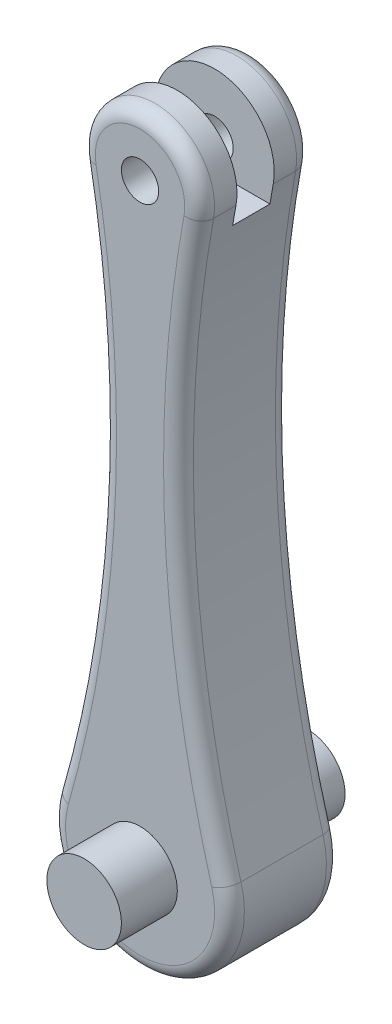
ISO-10303-21;
HEADER;
FILE_DESCRIPTION(('STEP AP214'),'2;1');
FILE_NAME('part.step','',(''),(''),'','','');
FILE_SCHEMA(('AUTOMOTIVE_DESIGN { 1 0 10303 214 1 1 1 1 }'));
ENDSEC;
DATA;
#1=APPLICATION_CONTEXT('core data for automotive mechanical design processes');
#2=APPLICATION_PROTOCOL_DEFINITION('international standard','automotive_design',2000,#1);
#3=PRODUCT_CONTEXT('',#1,'mechanical');
#4=PRODUCT('Part','Part','',(#3));
#5=PRODUCT_RELATED_PRODUCT_CATEGORY('part','',(#4));
#6=PRODUCT_DEFINITION_FORMATION('','',#4);
#7=PRODUCT_DEFINITION_CONTEXT('part definition',#1,'design');
#8=PRODUCT_DEFINITION('design','',#6,#7);
#9=PRODUCT_DEFINITION_SHAPE('','',#8);
#10=(LENGTH_UNIT() NAMED_UNIT(*) SI_UNIT(.MILLI.,.METRE.));
#11=(NAMED_UNIT(*) PLANE_ANGLE_UNIT() SI_UNIT($,.RADIAN.));
#12=(NAMED_UNIT(*) SI_UNIT($,.STERADIAN.) SOLID_ANGLE_UNIT());
#13=UNCERTAINTY_MEASURE_WITH_UNIT(LENGTH_MEASURE(1.E-05),#10,'distance_accuracy_value','');
#14=(GEOMETRIC_REPRESENTATION_CONTEXT(3) GLOBAL_UNCERTAINTY_ASSIGNED_CONTEXT((#13)) GLOBAL_UNIT_ASSIGNED_CONTEXT((#10,
#11,#12)) REPRESENTATION_CONTEXT('',''));
#15=CARTESIAN_POINT('',(0.,0.,0.));
#16=DIRECTION('',(0.,0.,1.));
#17=DIRECTION('',(1.,0.,0.));
#18=AXIS2_PLACEMENT_3D('',#15,#16,#17);
#19=CARTESIAN_POINT('',(0.,80.0000000000007,15.));
#20=DIRECTION('',(0.,0.,-1.));
#21=DIRECTION('',(-1.00000000000001,0.,0.));
#22=AXIS2_PLACEMENT_3D('',#19,#20,#21);
#23=CYLINDRICAL_SURFACE('',#22,8.);
#24=DIRECTION('',(0.,0.,-1.));
#25=VECTOR('',#24,1.);
#26=CARTESIAN_POINT('',(7.86840037202274,78.5549132947983,15.));
#27=LINE('',#26,#25);
#28=CARTESIAN_POINT('',(7.86840037202274,78.5549132947983,13.));
#29=VERTEX_POINT('',#28);
#30=CARTESIAN_POINT('',(7.86840037202274,78.5549132947983,9.99999999999999));
#31=VERTEX_POINT('',#30);
#32=EDGE_CURVE('E183',#29,#31,#27,.T.);
#33=ORIENTED_EDGE('',*,*,#32,.T.);
#34=CARTESIAN_POINT('',(0.,80.0000000000007,9.99999999999999));
#35=DIRECTION('',(0.,0.,1.));
#36=DIRECTION('',(1.00000000000001,0.,0.));
#37=AXIS2_PLACEMENT_3D('',#34,#35,#36);
#38=CIRCLE('',#37,8.);
#39=CARTESIAN_POINT('',(-7.86840037202283,78.5549132947983,9.99999999999999));
#40=VERTEX_POINT('',#39);
#41=EDGE_CURVE('E247',#31,#40,#38,.T.);
#42=ORIENTED_EDGE('',*,*,#41,.T.);
#43=DIRECTION('',(0.,0.,-1.));
#44=VECTOR('',#43,1.);
#45=CARTESIAN_POINT('',(-7.86840037202283,78.5549132947983,15.));
#46=LINE('',#45,#44);
#47=CARTESIAN_POINT('',(-7.86840037202283,78.5549132947983,13.));
#48=VERTEX_POINT('',#47);
#49=EDGE_CURVE('E180',#48,#40,#46,.T.);
#50=ORIENTED_EDGE('',*,*,#49,.F.);
#51=CARTESIAN_POINT('',(0.,80.0000000000007,13.));
#52=DIRECTION('',(0.,0.,1.));
#53=DIRECTION('',(1.00000000000001,0.,0.));
#54=AXIS2_PLACEMENT_3D('',#51,#52,#53);
#55=CIRCLE('',#54,8.);
#56=EDGE_CURVE('E214',#48,#29,#55,.F.);
#57=ORIENTED_EDGE('',*,*,#56,.T.);
#58=EDGE_LOOP('',(#33,#42,#50,#57));
#59=FACE_BOUND('',#58,.T.);
#60=ADVANCED_FACE('F46',(#59),#23,.T.);
#61=CARTESIAN_POINT('',(0.,80.0000000000007,15.));
#62=DIRECTION('',(0.,0.,-1.));
#63=DIRECTION('',(-1.00000000000001,0.,0.));
#64=AXIS2_PLACEMENT_3D('',#61,#62,#63);
#65=CYLINDRICAL_SURFACE('',#64,2.5);
#66=CARTESIAN_POINT('',(0.,80.0000000000007,9.99999999999999));
#67=DIRECTION('',(0.,0.,1.));
#68=DIRECTION('',(1.00000000000001,0.,0.));
#69=AXIS2_PLACEMENT_3D('',#66,#67,#68);
#70=CIRCLE('',#69,2.5);
#71=CARTESIAN_POINT('',(2.50000000000004,80.0000000000007,9.99999999999999));
#72=VERTEX_POINT('',#71);
#73=EDGE_CURVE('E149',#72,#72,#70,.T.);
#74=ORIENTED_EDGE('',*,*,#73,.F.);
#75=EDGE_LOOP('',(#74));
#76=FACE_BOUND('',#75,.T.);
#77=CARTESIAN_POINT('',(0.,80.0000000000007,15.));
#78=DIRECTION('',(0.,0.,1.));
#79=DIRECTION('',(1.00000000000001,0.,0.));
#80=AXIS2_PLACEMENT_3D('',#77,#78,#79);
#81=CIRCLE('',#80,2.5);
#82=CARTESIAN_POINT('',(2.50000000000004,80.0000000000007,15.));
#83=VERTEX_POINT('',#82);
#84=EDGE_CURVE('E172',#83,#83,#81,.T.);
#85=ORIENTED_EDGE('',*,*,#84,.T.);
#86=EDGE_LOOP('',(#85));
#87=FACE_BOUND('',#86,.T.);
#88=ADVANCED_FACE('F314',(#76,#87),#65,.F.);
#89=CARTESIAN_POINT('',(-85.0770790224961,64.3750000000004,15.));
#90=DIRECTION('',(0.,0.,1.));
#91=DIRECTION('',(1.00000000000001,0.,0.));
#92=AXIS2_PLACEMENT_3D('',#89,#90,#91);
#93=PLANE('',#92);
#94=CARTESIAN_POINT('',(0.,0.,15.));
#95=DIRECTION('',(0.,0.,1.));
#96=DIRECTION('',(1.00000000000001,0.,0.));
#97=AXIS2_PLACEMENT_3D('',#94,#95,#96);
#98=CIRCLE('',#97,5.);
#99=CARTESIAN_POINT('',(5.00000000000002,0.,15.));
#100=VERTEX_POINT('',#99);
#101=EDGE_CURVE('E13',#100,#100,#98,.T.);
#102=ORIENTED_EDGE('',*,*,#101,.F.);
#103=EDGE_LOOP('',(#102));
#104=FACE_BOUND('',#103,.T.);
#105=CARTESIAN_POINT('',(-170.154158044993,48.7500000000006,15.));
#106=DIRECTION('',(0.,0.,1.));
#107=DIRECTION('',(1.00000000000001,0.,0.));
#108=AXIS2_PLACEMENT_3D('',#105,#106,#107);
#109=CIRCLE('',#108,167.);
#110=CARTESIAN_POINT('',(-5.90130027901702,78.9161849710995,15.));
#111=VERTEX_POINT('',#110);
#112=CARTESIAN_POINT('',(-9.61322926807917,2.75423728813623,15.));
#113=VERTEX_POINT('',#112);
#114=EDGE_CURVE('E196',#111,#113,#109,.F.);
#115=ORIENTED_EDGE('',*,*,#114,.T.);
#116=CARTESIAN_POINT('',(0.,0.,15.));
#117=DIRECTION('',(0.,0.,1.));
#118=DIRECTION('',(1.00000000000001,0.,0.));
#119=AXIS2_PLACEMENT_3D('',#116,#117,#118);
#120=CIRCLE('',#119,10.);
#121=CARTESIAN_POINT('',(9.61322926807862,2.75423728813585,15.));
#122=VERTEX_POINT('',#121);
#123=EDGE_CURVE('E198',#113,#122,#120,.T.);
#124=ORIENTED_EDGE('',*,*,#123,.T.);
#125=CARTESIAN_POINT('',(170.154158044992,48.7500000000003,15.));
#126=DIRECTION('',(0.,0.,1.));
#127=DIRECTION('',(1.00000000000001,0.,0.));
#128=AXIS2_PLACEMENT_3D('',#125,#126,#127);
#129=CIRCLE('',#128,167.);
#130=CARTESIAN_POINT('',(5.9013002790174,78.9161849710991,15.));
#131=VERTEX_POINT('',#130);
#132=EDGE_CURVE('E192',#122,#131,#129,.F.);
#133=ORIENTED_EDGE('',*,*,#132,.T.);
#134=CARTESIAN_POINT('',(0.,80.0000000000007,15.));
#135=DIRECTION('',(0.,0.,1.));
#136=DIRECTION('',(1.00000000000001,0.,0.));
#137=AXIS2_PLACEMENT_3D('',#134,#135,#136);
#138=CIRCLE('',#137,6.);
#139=EDGE_CURVE('E194',#131,#111,#138,.T.);
#140=ORIENTED_EDGE('',*,*,#139,.T.);
#141=EDGE_LOOP('',(#115,#124,#133,#140));
#142=FACE_BOUND('',#141,.T.);
#143=ORIENTED_EDGE('',*,*,#84,.F.);
#144=EDGE_LOOP('',(#143));
#145=FACE_BOUND('',#144,.T.);
#146=ADVANCED_FACE('F284',(#104,#142,#145),#93,.T.);
#147=CARTESIAN_POINT('',(-85.0770790224961,64.3750000000004,0.));
#148=DIRECTION('',(0.,0.,1.));
#149=DIRECTION('',(1.00000000000001,0.,0.));
#150=AXIS2_PLACEMENT_3D('',#147,#148,#149);
#151=PLANE('',#150);
#152=CARTESIAN_POINT('',(0.,0.,0.));
#153=DIRECTION('',(0.,0.,1.));
#154=DIRECTION('',(1.00000000000001,0.,0.));
#155=AXIS2_PLACEMENT_3D('',#152,#153,#154);
#156=CIRCLE('',#155,5.);
#157=CARTESIAN_POINT('',(5.00000000000002,0.,0.));
#158=VERTEX_POINT('',#157);
#159=EDGE_CURVE('E50',#158,#158,#156,.T.);
#160=ORIENTED_EDGE('',*,*,#159,.T.);
#161=EDGE_LOOP('',(#160));
#162=FACE_BOUND('',#161,.T.);
#163=CARTESIAN_POINT('',(170.154158044992,48.7500000000003,0.));
#164=DIRECTION('',(0.,0.,1.));
#165=DIRECTION('',(1.00000000000001,0.,0.));
#166=AXIS2_PLACEMENT_3D('',#163,#164,#165);
#167=CIRCLE('',#166,167.);
#168=CARTESIAN_POINT('',(5.9013002790174,78.9161849710991,0.));
#169=VERTEX_POINT('',#168);
#170=CARTESIAN_POINT('',(9.61322926807862,2.75423728813585,0.));
#171=VERTEX_POINT('',#170);
#172=EDGE_CURVE('E216',#169,#171,#167,.T.);
#173=ORIENTED_EDGE('',*,*,#172,.T.);
#174=CARTESIAN_POINT('',(0.,0.,0.));
#175=DIRECTION('',(0.,0.,1.));
#176=DIRECTION('',(1.00000000000001,0.,0.));
#177=AXIS2_PLACEMENT_3D('',#174,#175,#176);
#178=CIRCLE('',#177,10.);
#179=CARTESIAN_POINT('',(-9.61322926807917,2.75423728813623,0.));
#180=VERTEX_POINT('',#179);
#181=EDGE_CURVE('E221',#171,#180,#178,.F.);
#182=ORIENTED_EDGE('',*,*,#181,.T.);
#183=CARTESIAN_POINT('',(-170.154158044993,48.7500000000006,0.));
#184=DIRECTION('',(0.,0.,1.));
#185=DIRECTION('',(1.00000000000001,0.,0.));
#186=AXIS2_PLACEMENT_3D('',#183,#184,#185);
#187=CIRCLE('',#186,167.);
#188=CARTESIAN_POINT('',(-5.90130027901702,78.9161849710995,0.));
#189=VERTEX_POINT('',#188);
#190=EDGE_CURVE('E70',#180,#189,#187,.T.);
#191=ORIENTED_EDGE('',*,*,#190,.T.);
#192=CARTESIAN_POINT('',(0.,80.0000000000007,0.));
#193=DIRECTION('',(0.,0.,1.));
#194=DIRECTION('',(1.00000000000001,0.,0.));
#195=AXIS2_PLACEMENT_3D('',#192,#193,#194);
#196=CIRCLE('',#195,6.);
#197=EDGE_CURVE('E218',#189,#169,#196,.F.);
#198=ORIENTED_EDGE('',*,*,#197,.T.);
#199=EDGE_LOOP('',(#173,#182,#191,#198));
#200=FACE_BOUND('',#199,.T.);
#201=CARTESIAN_POINT('',(0.,80.0000000000007,0.));
#202=DIRECTION('',(0.,0.,1.));
#203=DIRECTION('',(1.00000000000001,0.,0.));
#204=AXIS2_PLACEMENT_3D('',#201,#202,#203);
#205=CIRCLE('',#204,2.5);
#206=CARTESIAN_POINT('',(2.50000000000004,80.0000000000007,0.));
#207=VERTEX_POINT('',#206);
#208=EDGE_CURVE('E176',#207,#207,#205,.T.);
#209=ORIENTED_EDGE('',*,*,#208,.T.);
#210=EDGE_LOOP('',(#209));
#211=FACE_BOUND('',#210,.T.);
#212=ADVANCED_FACE('F299',(#162,#200,#211),#151,.F.);
#213=CARTESIAN_POINT('',(-170.154158044993,48.7500000000006,15.));
#214=DIRECTION('',(0.,0.,-1.));
#215=DIRECTION('',(-1.00000000000001,0.,0.));
#216=AXIS2_PLACEMENT_3D('',#213,#214,#215);
#217=CYLINDRICAL_SURFACE('',#216,165.);
#218=ORIENTED_EDGE('',*,*,#49,.T.);
#219=CARTESIAN_POINT('',(-170.154158044993,48.7500000000006,9.99999999999999));
#220=DIRECTION('',(0.,0.,1.));
#221=DIRECTION('',(1.00000000000001,0.,0.));
#222=AXIS2_PLACEMENT_3D('',#219,#220,#221);
#223=CIRCLE('',#222,165.);
#224=CARTESIAN_POINT('',(-7.4199043660767,76.0000032947986,9.99999999999999));
#225=VERTEX_POINT('',#224);
#226=EDGE_CURVE('E164',#40,#225,#223,.F.);
#227=ORIENTED_EDGE('',*,*,#226,.T.);
#228=DIRECTION('',(0.,0.,-1.));
#229=VECTOR('',#228,1.);
#230=CARTESIAN_POINT('',(-7.4199043660767,76.0000032947986,15.));
#231=LINE('',#230,#229);
#232=CARTESIAN_POINT('',(-7.4199043660767,76.0000032947986,4.99999999999999));
#233=VERTEX_POINT('',#232);
#234=EDGE_CURVE('E155',#225,#233,#231,.T.);
#235=ORIENTED_EDGE('',*,*,#234,.T.);
#236=CARTESIAN_POINT('',(-170.154158044993,48.7500000000006,4.99999999999999));
#237=DIRECTION('',(0.,0.,-1.));
#238=DIRECTION('',(-1.00000000000001,0.,0.));
#239=AXIS2_PLACEMENT_3D('',#236,#237,#238);
#240=CIRCLE('',#239,165.);
#241=CARTESIAN_POINT('',(-7.86840037202283,78.5549132947983,4.99999999999999));
#242=VERTEX_POINT('',#241);
#243=EDGE_CURVE('E139',#233,#242,#240,.F.);
#244=ORIENTED_EDGE('',*,*,#243,.T.);
#245=CARTESIAN_POINT('',(-7.86840037202283,78.5549132947983,2.));
#246=VERTEX_POINT('',#245);
#247=EDGE_CURVE('E175',#242,#246,#46,.T.);
#248=ORIENTED_EDGE('',*,*,#247,.T.);
#249=CARTESIAN_POINT('',(-170.154158044993,48.7500000000006,2.));
#250=DIRECTION('',(0.,0.,1.));
#251=DIRECTION('',(1.00000000000001,0.,0.));
#252=AXIS2_PLACEMENT_3D('',#249,#250,#251);
#253=CIRCLE('',#252,165.);
#254=CARTESIAN_POINT('',(-11.5358751216942,3.30508474576334,2.));
#255=VERTEX_POINT('',#254);
#256=EDGE_CURVE('E207',#246,#255,#253,.F.);
#257=ORIENTED_EDGE('',*,*,#256,.T.);
#258=DIRECTION('',(0.,0.,-1.));
#259=VECTOR('',#258,1.);
#260=CARTESIAN_POINT('',(-11.5358751216942,3.30508474576334,15.));
#261=LINE('',#260,#259);
#262=CARTESIAN_POINT('',(-11.5358751216942,3.30508474576334,13.));
#263=VERTEX_POINT('',#262);
#264=EDGE_CURVE('E189',#263,#255,#261,.T.);
#265=ORIENTED_EDGE('',*,*,#264,.F.);
#266=CARTESIAN_POINT('',(-170.154158044993,48.7500000000006,13.));
#267=DIRECTION('',(0.,0.,1.));
#268=DIRECTION('',(1.00000000000001,0.,0.));
#269=AXIS2_PLACEMENT_3D('',#266,#267,#268);
#270=CIRCLE('',#269,165.);
#271=EDGE_CURVE('E209',#263,#48,#270,.T.);
#272=ORIENTED_EDGE('',*,*,#271,.T.);
#273=EDGE_LOOP('',(#218,#227,#235,#244,#248,#257,#265,#272));
#274=FACE_BOUND('',#273,.T.);
#275=ADVANCED_FACE('F163',(#274),#217,.F.);
#276=CARTESIAN_POINT('',(0.,0.,15.));
#277=DIRECTION('',(0.,0.,-1.));
#278=DIRECTION('',(-1.00000000000001,0.,0.));
#279=AXIS2_PLACEMENT_3D('',#276,#277,#278);
#280=CYLINDRICAL_SURFACE('',#279,12.);
#281=DIRECTION('',(0.,0.,-1.));
#282=VECTOR('',#281,1.);
#283=CARTESIAN_POINT('',(11.5358751216943,3.3050847457628,15.));
#284=LINE('',#283,#282);
#285=CARTESIAN_POINT('',(11.5358751216943,3.3050847457628,13.));
#286=VERTEX_POINT('',#285);
#287=CARTESIAN_POINT('',(11.5358751216943,3.3050847457628,2.));
#288=VERTEX_POINT('',#287);
#289=EDGE_CURVE('E186',#286,#288,#284,.T.);
#290=ORIENTED_EDGE('',*,*,#289,.F.);
#291=CARTESIAN_POINT('',(0.,0.,13.));
#292=DIRECTION('',(0.,0.,1.));
#293=DIRECTION('',(1.00000000000001,0.,0.));
#294=AXIS2_PLACEMENT_3D('',#291,#292,#293);
#295=CIRCLE('',#294,12.);
#296=EDGE_CURVE('E204',#286,#263,#295,.F.);
#297=ORIENTED_EDGE('',*,*,#296,.T.);
#298=ORIENTED_EDGE('',*,*,#264,.T.);
#299=CARTESIAN_POINT('',(0.,0.,2.));
#300=DIRECTION('',(0.,0.,1.));
#301=DIRECTION('',(1.00000000000001,0.,0.));
#302=AXIS2_PLACEMENT_3D('',#299,#300,#301);
#303=CIRCLE('',#302,12.);
#304=EDGE_CURVE('E201',#255,#288,#303,.T.);
#305=ORIENTED_EDGE('',*,*,#304,.T.);
#306=EDGE_LOOP('',(#290,#297,#298,#305));
#307=FACE_BOUND('',#306,.T.);
#308=ADVANCED_FACE('F273',(#307),#280,.T.);
#309=CARTESIAN_POINT('',(170.154158044992,48.7500000000003,15.));
#310=DIRECTION('',(0.,0.,-1.));
#311=DIRECTION('',(-1.00000000000001,0.,0.));
#312=AXIS2_PLACEMENT_3D('',#309,#310,#311);
#313=CYLINDRICAL_SURFACE('',#312,165.);
#314=DIRECTION('',(0.,0.,-1.));
#315=VECTOR('',#314,1.);
#316=CARTESIAN_POINT('',(7.41990436607648,76.0000032947986,15.));
#317=LINE('',#316,#315);
#318=CARTESIAN_POINT('',(7.41990436607648,76.0000032947986,4.99999999999999));
#319=VERTEX_POINT('',#318);
#320=CARTESIAN_POINT('',(7.41990436607648,76.0000032947986,9.99999999999999));
#321=VERTEX_POINT('',#320);
#322=EDGE_CURVE('E55',#319,#321,#317,.F.);
#323=ORIENTED_EDGE('',*,*,#322,.T.);
#324=CARTESIAN_POINT('',(170.154158044992,48.7500000000003,9.99999999999999));
#325=DIRECTION('',(0.,0.,1.));
#326=DIRECTION('',(1.00000000000001,0.,0.));
#327=AXIS2_PLACEMENT_3D('',#324,#325,#326);
#328=CIRCLE('',#327,165.);
#329=EDGE_CURVE('E168',#321,#31,#328,.F.);
#330=ORIENTED_EDGE('',*,*,#329,.T.);
#331=ORIENTED_EDGE('',*,*,#32,.F.);
#332=CARTESIAN_POINT('',(170.154158044992,48.7500000000003,13.));
#333=DIRECTION('',(0.,0.,1.));
#334=DIRECTION('',(1.00000000000001,0.,0.));
#335=AXIS2_PLACEMENT_3D('',#332,#333,#334);
#336=CIRCLE('',#335,165.);
#337=EDGE_CURVE('E226',#29,#286,#336,.T.);
#338=ORIENTED_EDGE('',*,*,#337,.T.);
#339=ORIENTED_EDGE('',*,*,#289,.T.);
#340=CARTESIAN_POINT('',(170.154158044992,48.7500000000003,2.));
#341=DIRECTION('',(0.,0.,1.));
#342=DIRECTION('',(1.00000000000001,0.,0.));
#343=AXIS2_PLACEMENT_3D('',#340,#341,#342);
#344=CIRCLE('',#343,165.);
#345=CARTESIAN_POINT('',(7.86840037202274,78.5549132947983,2.));
#346=VERTEX_POINT('',#345);
#347=EDGE_CURVE('E223',#288,#346,#344,.F.);
#348=ORIENTED_EDGE('',*,*,#347,.T.);
#349=CARTESIAN_POINT('',(7.86840037202274,78.5549132947983,4.99999999999999));
#350=VERTEX_POINT('',#349);
#351=EDGE_CURVE('E182',#350,#346,#27,.T.);
#352=ORIENTED_EDGE('',*,*,#351,.F.);
#353=CARTESIAN_POINT('',(170.154158044992,48.7500000000003,4.99999999999999));
#354=DIRECTION('',(0.,0.,-1.));
#355=DIRECTION('',(-1.00000000000001,0.,0.));
#356=AXIS2_PLACEMENT_3D('',#353,#354,#355);
#357=CIRCLE('',#356,165.);
#358=EDGE_CURVE('E150',#350,#319,#357,.F.);
#359=ORIENTED_EDGE('',*,*,#358,.T.);
#360=EDGE_LOOP('',(#323,#330,#331,#338,#339,#348,#352,#359));
#361=FACE_BOUND('',#360,.T.);
#362=ADVANCED_FACE('F250',(#361),#313,.F.);
#363=CARTESIAN_POINT('',(0.,80.0000000000007,4.99999999999999));
#364=DIRECTION('',(0.,0.,-1.));
#365=DIRECTION('',(-1.00000000000001,0.,0.));
#366=AXIS2_PLACEMENT_3D('',#363,#364,#365);
#367=CIRCLE('',#366,8.);
#368=EDGE_CURVE('E145',#242,#350,#367,.T.);
#369=ORIENTED_EDGE('',*,*,#368,.T.);
#370=ORIENTED_EDGE('',*,*,#351,.T.);
#371=CARTESIAN_POINT('',(0.,80.0000000000007,2.));
#372=DIRECTION('',(0.,0.,1.));
#373=DIRECTION('',(1.00000000000001,0.,0.));
#374=AXIS2_PLACEMENT_3D('',#371,#372,#373);
#375=CIRCLE('',#374,8.);
#376=EDGE_CURVE('E211',#346,#246,#375,.T.);
#377=ORIENTED_EDGE('',*,*,#376,.T.);
#378=ORIENTED_EDGE('',*,*,#247,.F.);
#379=EDGE_LOOP('',(#369,#370,#377,#378));
#380=FACE_BOUND('',#379,.T.);
#381=ADVANCED_FACE('F316',(#380),#23,.T.);
#382=CARTESIAN_POINT('',(0.,80.0000000000007,4.99999999999999));
#383=DIRECTION('',(0.,0.,-1.));
#384=DIRECTION('',(-1.00000000000001,0.,0.));
#385=AXIS2_PLACEMENT_3D('',#382,#383,#384);
#386=CIRCLE('',#385,2.5);
#387=CARTESIAN_POINT('',(-2.49999999999999,80.0000000000007,4.99999999999999));
#388=VERTEX_POINT('',#387);
#389=EDGE_CURVE('E158',#388,#388,#386,.T.);
#390=ORIENTED_EDGE('',*,*,#389,.F.);
#391=EDGE_LOOP('',(#390));
#392=FACE_BOUND('',#391,.T.);
#393=ORIENTED_EDGE('',*,*,#208,.F.);
#394=EDGE_LOOP('',(#393));
#395=FACE_BOUND('',#394,.T.);
#396=ADVANCED_FACE('F322',(#392,#395),#65,.F.);
#397=CARTESIAN_POINT('',(0.,80.0000000000007,13.));
#398=DIRECTION('',(0.,0.,1.));
#399=DIRECTION('',(1.00000000000001,0.,0.));
#400=AXIS2_PLACEMENT_3D('',#397,#398,#399);
#401=TOROIDAL_SURFACE('',#400,6.,2.);
#402=CARTESIAN_POINT('',(5.9013002790174,78.9161849710991,13.));
#403=DIRECTION('',(-0.180635838150291,-0.983550046502847,0.));
#404=DIRECTION('',(0.983550046502848,-0.180635838150291,0.));
#405=AXIS2_PLACEMENT_3D('',#402,#403,#404);
#406=CIRCLE('',#405,2.);
#407=EDGE_CURVE('E233',#29,#131,#406,.T.);
#408=ORIENTED_EDGE('',*,*,#407,.F.);
#409=ORIENTED_EDGE('',*,*,#56,.F.);
#410=CARTESIAN_POINT('',(-5.90130027901702,78.9161849710995,13.));
#411=DIRECTION('',(0.180635838150292,-0.983550046502848,0.));
#412=DIRECTION('',(0.983550046502848,0.180635838150292,0.));
#413=AXIS2_PLACEMENT_3D('',#410,#411,#412);
#414=CIRCLE('',#413,2.);
#415=EDGE_CURVE('E179',#111,#48,#414,.T.);
#416=ORIENTED_EDGE('',*,*,#415,.F.);
#417=ORIENTED_EDGE('',*,*,#139,.F.);
#418=EDGE_LOOP('',(#408,#409,#416,#417));
#419=FACE_BOUND('',#418,.T.);
#420=ADVANCED_FACE('F287',(#419),#401,.T.);
#421=CARTESIAN_POINT('',(-170.154158044993,48.7500000000006,13.));
#422=DIRECTION('',(0.,0.,1.));
#423=DIRECTION('',(1.00000000000001,0.,0.));
#424=AXIS2_PLACEMENT_3D('',#421,#422,#423);
#425=TOROIDAL_SURFACE('',#424,167.,2.);
#426=ORIENTED_EDGE('',*,*,#415,.T.);
#427=ORIENTED_EDGE('',*,*,#271,.F.);
#428=CARTESIAN_POINT('',(-9.61322926807917,2.75423728813623,13.));
#429=DIRECTION('',(-0.275423728813561,-0.961322926807867,0.));
#430=DIRECTION('',(0.961322926807867,-0.275423728813561,0.));
#431=AXIS2_PLACEMENT_3D('',#428,#429,#430);
#432=CIRCLE('',#431,2.);
#433=EDGE_CURVE('E230',#113,#263,#432,.T.);
#434=ORIENTED_EDGE('',*,*,#433,.F.);
#435=ORIENTED_EDGE('',*,*,#114,.F.);
#436=EDGE_LOOP('',(#426,#427,#434,#435));
#437=FACE_BOUND('',#436,.T.);
#438=ADVANCED_FACE('F266',(#437),#425,.T.);
#439=CARTESIAN_POINT('',(170.154158044992,48.7500000000003,13.));
#440=DIRECTION('',(0.,0.,1.));
#441=DIRECTION('',(1.00000000000001,0.,0.));
#442=AXIS2_PLACEMENT_3D('',#439,#440,#441);
#443=TOROIDAL_SURFACE('',#442,167.,2.);
#444=ORIENTED_EDGE('',*,*,#407,.T.);
#445=ORIENTED_EDGE('',*,*,#132,.F.);
#446=CARTESIAN_POINT('',(9.61322926807862,2.7542372881358,13.));
#447=DIRECTION('',(0.275423728813561,-0.961322926807868,0.));
#448=DIRECTION('',(0.961322926807868,0.275423728813561,0.));
#449=AXIS2_PLACEMENT_3D('',#446,#447,#448);
#450=CIRCLE('',#449,2.);
#451=EDGE_CURVE('E228',#286,#122,#450,.T.);
#452=ORIENTED_EDGE('',*,*,#451,.F.);
#453=ORIENTED_EDGE('',*,*,#337,.F.);
#454=EDGE_LOOP('',(#444,#445,#452,#453));
#455=FACE_BOUND('',#454,.T.);
#456=ADVANCED_FACE('F280',(#455),#443,.T.);
#457=CARTESIAN_POINT('',(0.,0.,13.));
#458=DIRECTION('',(0.,0.,1.));
#459=DIRECTION('',(1.00000000000001,0.,0.));
#460=AXIS2_PLACEMENT_3D('',#457,#458,#459);
#461=TOROIDAL_SURFACE('',#460,10.,2.);
#462=ORIENTED_EDGE('',*,*,#433,.T.);
#463=ORIENTED_EDGE('',*,*,#296,.F.);
#464=ORIENTED_EDGE('',*,*,#451,.T.);
#465=ORIENTED_EDGE('',*,*,#123,.F.);
#466=EDGE_LOOP('',(#462,#463,#464,#465));
#467=FACE_BOUND('',#466,.T.);
#468=ADVANCED_FACE('F276',(#467),#461,.T.);
#469=CARTESIAN_POINT('',(0.,80.0000000000007,2.));
#470=DIRECTION('',(0.,0.,1.));
#471=DIRECTION('',(1.00000000000001,0.,0.));
#472=AXIS2_PLACEMENT_3D('',#469,#470,#471);
#473=TOROIDAL_SURFACE('',#472,6.,2.);
#474=CARTESIAN_POINT('',(5.9013002790174,78.9161849710991,2.));
#475=DIRECTION('',(-0.180635838150291,-0.983550046502847,0.));
#476=DIRECTION('',(0.983550046502848,-0.180635838150291,0.));
#477=AXIS2_PLACEMENT_3D('',#474,#475,#476);
#478=CIRCLE('',#477,2.);
#479=EDGE_CURVE('E239',#169,#346,#478,.T.);
#480=ORIENTED_EDGE('',*,*,#479,.F.);
#481=ORIENTED_EDGE('',*,*,#197,.F.);
#482=CARTESIAN_POINT('',(-5.90130027901702,78.9161849710995,2.));
#483=DIRECTION('',(0.180635838150292,-0.983550046502848,0.));
#484=DIRECTION('',(0.983550046502848,0.180635838150292,0.));
#485=AXIS2_PLACEMENT_3D('',#482,#483,#484);
#486=CIRCLE('',#485,2.);
#487=EDGE_CURVE('E231',#246,#189,#486,.T.);
#488=ORIENTED_EDGE('',*,*,#487,.F.);
#489=ORIENTED_EDGE('',*,*,#376,.F.);
#490=EDGE_LOOP('',(#480,#481,#488,#489));
#491=FACE_BOUND('',#490,.T.);
#492=ADVANCED_FACE('F48',(#491),#473,.T.);
#493=CARTESIAN_POINT('',(-170.154158044993,48.7500000000006,2.));
#494=DIRECTION('',(0.,0.,1.));
#495=DIRECTION('',(1.00000000000001,0.,0.));
#496=AXIS2_PLACEMENT_3D('',#493,#494,#495);
#497=TOROIDAL_SURFACE('',#496,167.,2.);
#498=ORIENTED_EDGE('',*,*,#487,.T.);
#499=ORIENTED_EDGE('',*,*,#190,.F.);
#500=CARTESIAN_POINT('',(-9.61322926807874,2.75423728813574,2.));
#501=DIRECTION('',(-0.275423728813561,-0.961322926807866,0.));
#502=DIRECTION('',(0.961322926807867,-0.275423728813561,0.));
#503=AXIS2_PLACEMENT_3D('',#500,#501,#502);
#504=CIRCLE('',#503,2.);
#505=EDGE_CURVE('E63',#255,#180,#504,.T.);
#506=ORIENTED_EDGE('',*,*,#505,.F.);
#507=ORIENTED_EDGE('',*,*,#256,.F.);
#508=EDGE_LOOP('',(#498,#499,#506,#507));
#509=FACE_BOUND('',#508,.T.);
#510=ADVANCED_FACE('F310',(#509),#497,.T.);
#511=CARTESIAN_POINT('',(170.154158044992,48.7500000000003,2.));
#512=DIRECTION('',(0.,0.,1.));
#513=DIRECTION('',(1.00000000000001,0.,0.));
#514=AXIS2_PLACEMENT_3D('',#511,#512,#513);
#515=TOROIDAL_SURFACE('',#514,167.,2.);
#516=ORIENTED_EDGE('',*,*,#479,.T.);
#517=ORIENTED_EDGE('',*,*,#347,.F.);
#518=CARTESIAN_POINT('',(9.61322926807862,2.75423728813585,2.));
#519=DIRECTION('',(0.275423728813567,-0.961322926807864,0.));
#520=DIRECTION('',(0.961322926807865,0.275423728813567,0.));
#521=AXIS2_PLACEMENT_3D('',#518,#519,#520);
#522=CIRCLE('',#521,2.);
#523=EDGE_CURVE('E165',#171,#288,#522,.T.);
#524=ORIENTED_EDGE('',*,*,#523,.F.);
#525=ORIENTED_EDGE('',*,*,#172,.F.);
#526=EDGE_LOOP('',(#516,#517,#524,#525));
#527=FACE_BOUND('',#526,.T.);
#528=ADVANCED_FACE('F298',(#527),#515,.T.);
#529=CARTESIAN_POINT('',(0.,0.,2.));
#530=DIRECTION('',(0.,0.,1.));
#531=DIRECTION('',(1.00000000000001,0.,0.));
#532=AXIS2_PLACEMENT_3D('',#529,#530,#531);
#533=TOROIDAL_SURFACE('',#532,10.,2.);
#534=ORIENTED_EDGE('',*,*,#505,.T.);
#535=ORIENTED_EDGE('',*,*,#181,.F.);
#536=ORIENTED_EDGE('',*,*,#523,.T.);
#537=ORIENTED_EDGE('',*,*,#304,.F.);
#538=EDGE_LOOP('',(#534,#535,#536,#537));
#539=FACE_BOUND('',#538,.T.);
#540=ADVANCED_FACE('F301',(#539),#533,.T.);
#541=CARTESIAN_POINT('',(-12.,76.0000032947986,4.99999999999999));
#542=DIRECTION('',(0.,-1.00000000000001,0.));
#543=DIRECTION('',(0.,0.,-1.));
#544=AXIS2_PLACEMENT_3D('',#541,#542,#543);
#545=PLANE('',#544);
#546=DIRECTION('',(1.00000000000001,0.,0.));
#547=VECTOR('',#546,1.);
#548=CARTESIAN_POINT('',(-12.,76.0000032947986,9.99999999999999));
#549=LINE('',#548,#547);
#550=EDGE_CURVE('E159',#225,#321,#549,.T.);
#551=ORIENTED_EDGE('',*,*,#550,.T.);
#552=ORIENTED_EDGE('',*,*,#322,.F.);
#553=DIRECTION('',(1.00000000000001,0.,0.));
#554=VECTOR('',#553,1.);
#555=CARTESIAN_POINT('',(-12.,76.0000032947986,4.99999999999999));
#556=LINE('',#555,#554);
#557=EDGE_CURVE('E143',#233,#319,#556,.T.);
#558=ORIENTED_EDGE('',*,*,#557,.F.);
#559=ORIENTED_EDGE('',*,*,#234,.F.);
#560=EDGE_LOOP('',(#551,#552,#558,#559));
#561=FACE_BOUND('',#560,.T.);
#562=ADVANCED_FACE('F154',(#561),#545,.F.);
#563=CARTESIAN_POINT('',(-12.,76.0000032947986,9.99999999999999));
#564=DIRECTION('',(0.,0.,1.));
#565=DIRECTION('',(1.00000000000001,0.,0.));
#566=AXIS2_PLACEMENT_3D('',#563,#564,#565);
#567=PLANE('',#566);
#568=ORIENTED_EDGE('',*,*,#73,.T.);
#569=EDGE_LOOP('',(#568));
#570=FACE_BOUND('',#569,.T.);
#571=ORIENTED_EDGE('',*,*,#41,.F.);
#572=ORIENTED_EDGE('',*,*,#329,.F.);
#573=ORIENTED_EDGE('',*,*,#550,.F.);
#574=ORIENTED_EDGE('',*,*,#226,.F.);
#575=EDGE_LOOP('',(#571,#572,#573,#574));
#576=FACE_BOUND('',#575,.T.);
#577=ADVANCED_FACE('F308',(#570,#576),#567,.F.);
#578=CARTESIAN_POINT('',(-12.,76.0000032947986,4.99999999999999));
#579=DIRECTION('',(0.,0.,-1.));
#580=DIRECTION('',(-1.00000000000001,0.,0.));
#581=AXIS2_PLACEMENT_3D('',#578,#579,#580);
#582=PLANE('',#581);
#583=ORIENTED_EDGE('',*,*,#389,.T.);
#584=EDGE_LOOP('',(#583));
#585=FACE_BOUND('',#584,.T.);
#586=ORIENTED_EDGE('',*,*,#557,.T.);
#587=ORIENTED_EDGE('',*,*,#358,.F.);
#588=ORIENTED_EDGE('',*,*,#368,.F.);
#589=ORIENTED_EDGE('',*,*,#243,.F.);
#590=EDGE_LOOP('',(#586,#587,#588,#589));
#591=FACE_BOUND('',#590,.T.);
#592=ADVANCED_FACE('F141',(#585,#591),#582,.F.);
#593=CARTESIAN_POINT('',(0.,0.,-7.49999999999999));
#594=DIRECTION('',(0.,0.,1.));
#595=DIRECTION('',(1.00000000000001,0.,0.));
#596=AXIS2_PLACEMENT_3D('',#593,#594,#595);
#597=PLANE('',#596);
#598=CARTESIAN_POINT('',(0.,0.,-7.49999999999999));
#599=DIRECTION('',(0.,0.,1.));
#600=DIRECTION('',(1.00000000000001,0.,0.));
#601=AXIS2_PLACEMENT_3D('',#598,#599,#600);
#602=CIRCLE('',#601,5.);
#603=CARTESIAN_POINT('',(5.00000000000002,0.,-7.49999999999999));
#604=VERTEX_POINT('',#603);
#605=EDGE_CURVE('E442',#604,#604,#602,.T.);
#606=ORIENTED_EDGE('',*,*,#605,.F.);
#607=EDGE_LOOP('',(#606));
#608=FACE_BOUND('',#607,.T.);
#609=ADVANCED_FACE('F398',(#608),#597,.F.);
#610=CARTESIAN_POINT('',(0.,0.,-7.49999999999999));
#611=DIRECTION('',(0.,0.,1.));
#612=DIRECTION('',(1.00000000000001,0.,0.));
#613=AXIS2_PLACEMENT_3D('',#610,#611,#612);
#614=CYLINDRICAL_SURFACE('',#613,5.);
#615=ORIENTED_EDGE('',*,*,#605,.T.);
#616=EDGE_LOOP('',(#615));
#617=FACE_BOUND('',#616,.T.);
#618=ORIENTED_EDGE('',*,*,#159,.F.);
#619=EDGE_LOOP('',(#618));
#620=FACE_BOUND('',#619,.T.);
#621=ADVANCED_FACE('F406',(#617,#620),#614,.T.);
#622=ORIENTED_EDGE('',*,*,#101,.T.);
#623=EDGE_LOOP('',(#622));
#624=FACE_BOUND('',#623,.T.);
#625=CARTESIAN_POINT('',(0.,0.,22.5));
#626=DIRECTION('',(0.,0.,1.));
#627=DIRECTION('',(1.00000000000001,0.,0.));
#628=AXIS2_PLACEMENT_3D('',#625,#626,#627);
#629=CIRCLE('',#628,5.);
#630=CARTESIAN_POINT('',(5.00000000000002,0.,22.5));
#631=VERTEX_POINT('',#630);
#632=EDGE_CURVE('E444',#631,#631,#629,.T.);
#633=ORIENTED_EDGE('',*,*,#632,.F.);
#634=EDGE_LOOP('',(#633));
#635=FACE_BOUND('',#634,.T.);
#636=ADVANCED_FACE('F414',(#624,#635),#614,.T.);
#637=CARTESIAN_POINT('',(0.,0.,22.5));
#638=DIRECTION('',(0.,0.,1.));
#639=DIRECTION('',(1.00000000000001,0.,0.));
#640=AXIS2_PLACEMENT_3D('',#637,#638,#639);
#641=PLANE('',#640);
#642=ORIENTED_EDGE('',*,*,#632,.T.);
#643=EDGE_LOOP('',(#642));
#644=FACE_BOUND('',#643,.T.);
#645=ADVANCED_FACE('F422',(#644),#641,.T.);
#646=CLOSED_SHELL('',(#60,#88,#146,#212,#275,#308,#362,#381,#396,#420,#438,#456,#468,#492,#510,
#528,#540,#562,#577,#592,#609,#621,#636,#645));
#647=MANIFOLD_SOLID_BREP('B2',#646);
#648=ADVANCED_BREP_SHAPE_REPRESENTATION('',(#18,#647),#14);
#649=SHAPE_DEFINITION_REPRESENTATION(#9,#648);
ENDSEC;
END-ISO-10303-21;
